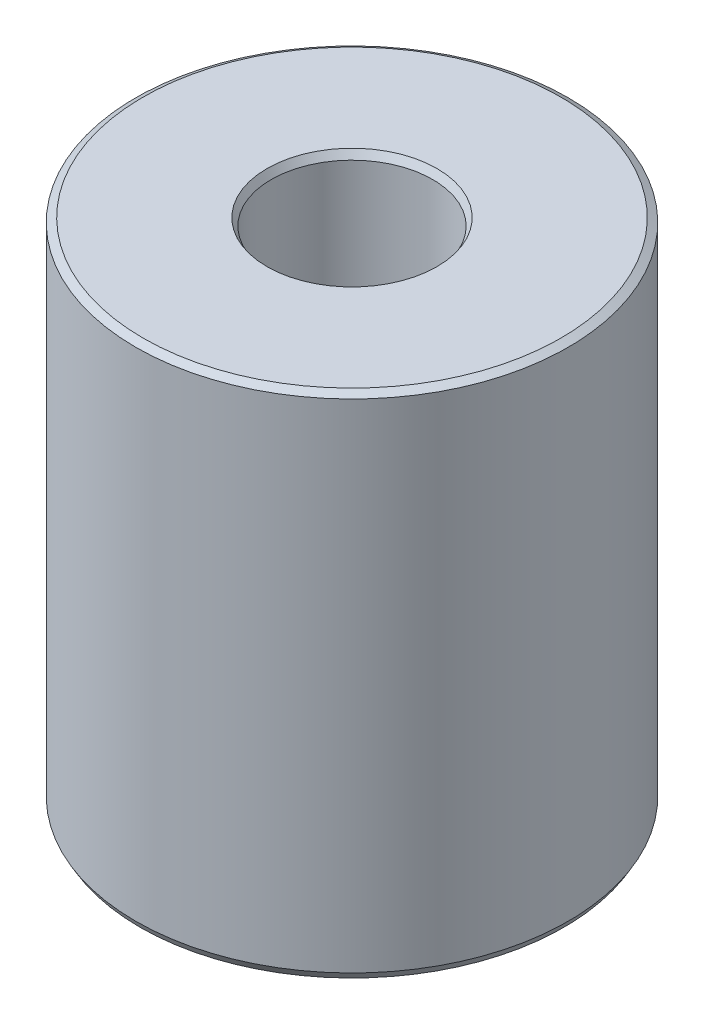
ISO-10303-21;
HEADER;
FILE_DESCRIPTION(('STEP AP214'),'2;1');
FILE_NAME('part.step','',(''),(''),'','','');
FILE_SCHEMA(('AUTOMOTIVE_DESIGN { 1 0 10303 214 1 1 1 1 }'));
ENDSEC;
DATA;
#1=APPLICATION_CONTEXT('core data for automotive mechanical design processes');
#2=APPLICATION_PROTOCOL_DEFINITION('international standard','automotive_design',2000,#1);
#3=PRODUCT_CONTEXT('',#1,'mechanical');
#4=PRODUCT('Part','Part','',(#3));
#5=PRODUCT_RELATED_PRODUCT_CATEGORY('part','',(#4));
#6=PRODUCT_DEFINITION_FORMATION('','',#4);
#7=PRODUCT_DEFINITION_CONTEXT('part definition',#1,'design');
#8=PRODUCT_DEFINITION('design','',#6,#7);
#9=PRODUCT_DEFINITION_SHAPE('','',#8);
#10=(LENGTH_UNIT() NAMED_UNIT(*) SI_UNIT(.MILLI.,.METRE.));
#11=(NAMED_UNIT(*) PLANE_ANGLE_UNIT() SI_UNIT($,.RADIAN.));
#12=(NAMED_UNIT(*) SI_UNIT($,.STERADIAN.) SOLID_ANGLE_UNIT());
#13=UNCERTAINTY_MEASURE_WITH_UNIT(LENGTH_MEASURE(1.E-05),#10,'distance_accuracy_value','');
#14=(GEOMETRIC_REPRESENTATION_CONTEXT(3) GLOBAL_UNCERTAINTY_ASSIGNED_CONTEXT((#13)) GLOBAL_UNIT_ASSIGNED_CONTEXT((#10,
#11,#12)) REPRESENTATION_CONTEXT('',''));
#15=CARTESIAN_POINT('',(0.,0.,0.));
#16=DIRECTION('',(0.,0.,1.));
#17=DIRECTION('',(1.,0.,0.));
#18=AXIS2_PLACEMENT_3D('',#15,#16,#17);
#19=CARTESIAN_POINT('',(0.,52.939973360736,0.));
#20=DIRECTION('',(0.,-1.,0.));
#21=DIRECTION('',(0.,0.,-1.));
#22=AXIS2_PLACEMENT_3D('',#19,#20,#21);
#23=CYLINDRICAL_SURFACE('',#22,22.5);
#24=CARTESIAN_POINT('',(0.,0.765818197632044,0.));
#25=DIRECTION('',(0.,1.,0.));
#26=DIRECTION('',(0.,0.,1.));
#27=AXIS2_PLACEMENT_3D('',#24,#25,#26);
#28=CIRCLE('',#27,22.5);
#29=CARTESIAN_POINT('',(0.,0.765818197632044,22.5));
#30=VERTEX_POINT('',#29);
#31=EDGE_CURVE('E10',#30,#30,#28,.T.);
#32=ORIENTED_EDGE('',*,*,#31,.T.);
#33=EDGE_LOOP('',(#32));
#34=FACE_BOUND('',#33,.T.);
#35=CARTESIAN_POINT('',(0.,52.4978280181829,0.));
#36=DIRECTION('',(0.,1.,0.));
#37=DIRECTION('',(0.,0.,1.));
#38=AXIS2_PLACEMENT_3D('',#35,#36,#37);
#39=CIRCLE('',#38,22.5);
#40=CARTESIAN_POINT('',(0.,52.4978280181829,22.5));
#41=VERTEX_POINT('',#40);
#42=EDGE_CURVE('E50',#41,#41,#39,.F.);
#43=ORIENTED_EDGE('',*,*,#42,.T.);
#44=EDGE_LOOP('',(#43));
#45=FACE_BOUND('',#44,.T.);
#46=ADVANCED_FACE('F39',(#34,#45),#23,.T.);
#47=CARTESIAN_POINT('',(0.,52.939973360736,0.));
#48=DIRECTION('',(0.,1.,0.));
#49=DIRECTION('',(0.,0.,1.));
#50=AXIS2_PLACEMENT_3D('',#47,#48,#49);
#51=PLANE('',#50);
#52=CARTESIAN_POINT('',(0.,52.939973360736,0.));
#53=DIRECTION('',(0.,1.,0.));
#54=DIRECTION('',(0.,0.,1.));
#55=AXIS2_PLACEMENT_3D('',#52,#53,#54);
#56=CIRCLE('',#55,8.84591755321129);
#57=CARTESIAN_POINT('',(0.,52.939973360736,8.84591755321129));
#58=VERTEX_POINT('',#57);
#59=EDGE_CURVE('E58',#58,#58,#56,.F.);
#60=ORIENTED_EDGE('',*,*,#59,.T.);
#61=EDGE_LOOP('',(#60));
#62=FACE_BOUND('',#61,.T.);
#63=CARTESIAN_POINT('',(0.,52.939973360736,0.));
#64=DIRECTION('',(0.,1.,0.));
#65=DIRECTION('',(0.,0.,1.));
#66=AXIS2_PLACEMENT_3D('',#63,#64,#65);
#67=CIRCLE('',#66,21.734181802368);
#68=CARTESIAN_POINT('',(0.,52.939973360736,21.734181802368));
#69=VERTEX_POINT('',#68);
#70=EDGE_CURVE('E61',#69,#69,#67,.T.);
#71=ORIENTED_EDGE('',*,*,#70,.T.);
#72=EDGE_LOOP('',(#71));
#73=FACE_BOUND('',#72,.T.);
#74=ADVANCED_FACE('F88',(#62,#73),#51,.T.);
#75=CARTESIAN_POINT('',(0.,0.,0.));
#76=DIRECTION('',(0.,1.,0.));
#77=DIRECTION('',(0.,0.,1.));
#78=AXIS2_PLACEMENT_3D('',#75,#76,#77);
#79=PLANE('',#78);
#80=CARTESIAN_POINT('',(0.,0.,0.));
#81=DIRECTION('',(0.,1.,0.));
#82=DIRECTION('',(0.,0.,1.));
#83=AXIS2_PLACEMENT_3D('',#80,#81,#82);
#84=CIRCLE('',#83,9.16959040829013);
#85=CARTESIAN_POINT('',(0.,0.,9.16959040829013));
#86=VERTEX_POINT('',#85);
#87=EDGE_CURVE('E51',#86,#86,#84,.T.);
#88=ORIENTED_EDGE('',*,*,#87,.T.);
#89=EDGE_LOOP('',(#88));
#90=FACE_BOUND('',#89,.T.);
#91=CARTESIAN_POINT('',(0.,0.,0.));
#92=DIRECTION('',(0.,1.,0.));
#93=DIRECTION('',(0.,0.,1.));
#94=AXIS2_PLACEMENT_3D('',#91,#92,#93);
#95=CIRCLE('',#94,22.0578546574468);
#96=CARTESIAN_POINT('',(0.,0.,22.0578546574468));
#97=VERTEX_POINT('',#96);
#98=EDGE_CURVE('E54',#97,#97,#95,.F.);
#99=ORIENTED_EDGE('',*,*,#98,.T.);
#100=EDGE_LOOP('',(#99));
#101=FACE_BOUND('',#100,.T.);
#102=ADVANCED_FACE('F83',(#90,#101),#79,.F.);
#103=CARTESIAN_POINT('',(0.,52.939973360736,0.));
#104=DIRECTION('',(0.,-1.,0.));
#105=DIRECTION('',(0.,0.,-1.));
#106=AXIS2_PLACEMENT_3D('',#103,#104,#105);
#107=CYLINDRICAL_SURFACE('',#106,8.40377221065813);
#108=CARTESIAN_POINT('',(0.,52.174155163104,0.));
#109=DIRECTION('',(0.,1.,0.));
#110=DIRECTION('',(0.,0.,1.));
#111=AXIS2_PLACEMENT_3D('',#108,#109,#110);
#112=CIRCLE('',#111,8.40377221065813);
#113=CARTESIAN_POINT('',(0.,52.174155163104,8.40377221065813));
#114=VERTEX_POINT('',#113);
#115=EDGE_CURVE('E67',#114,#114,#112,.T.);
#116=ORIENTED_EDGE('',*,*,#115,.T.);
#117=EDGE_LOOP('',(#116));
#118=FACE_BOUND('',#117,.T.);
#119=CARTESIAN_POINT('',(0.,0.442145342553164,0.));
#120=DIRECTION('',(0.,1.,0.));
#121=DIRECTION('',(0.,0.,1.));
#122=AXIS2_PLACEMENT_3D('',#119,#120,#121);
#123=CIRCLE('',#122,8.40377221065813);
#124=CARTESIAN_POINT('',(0.,0.442145342553164,8.40377221065813));
#125=VERTEX_POINT('',#124);
#126=EDGE_CURVE('E69',#125,#125,#123,.F.);
#127=ORIENTED_EDGE('',*,*,#126,.T.);
#128=EDGE_LOOP('',(#127));
#129=FACE_BOUND('',#128,.T.);
#130=ADVANCED_FACE('F71',(#118,#129),#107,.F.);
#131=CARTESIAN_POINT('',(0.,52.174155163104,0.));
#132=DIRECTION('',(0.,1.,0.));
#133=DIRECTION('',(0.,0.,1.));
#134=AXIS2_PLACEMENT_3D('',#131,#132,#133);
#135=CONICAL_SURFACE('',#134,8.40377221065813,0.523598775598302);
#136=ORIENTED_EDGE('',*,*,#59,.F.);
#137=EDGE_LOOP('',(#136));
#138=FACE_BOUND('',#137,.T.);
#139=ORIENTED_EDGE('',*,*,#115,.F.);
#140=EDGE_LOOP('',(#139));
#141=FACE_BOUND('',#140,.T.);
#142=ADVANCED_FACE('F77',(#138,#141),#135,.F.);
#143=CARTESIAN_POINT('',(0.,0.,0.));
#144=DIRECTION('',(0.,-1.,0.));
#145=DIRECTION('',(0.,0.,-1.));
#146=AXIS2_PLACEMENT_3D('',#143,#144,#145);
#147=CONICAL_SURFACE('',#146,9.16959040829013,1.04719755119659);
#148=ORIENTED_EDGE('',*,*,#126,.F.);
#149=EDGE_LOOP('',(#148));
#150=FACE_BOUND('',#149,.T.);
#151=ORIENTED_EDGE('',*,*,#87,.F.);
#152=EDGE_LOOP('',(#151));
#153=FACE_BOUND('',#152,.T.);
#154=ADVANCED_FACE('F73',(#150,#153),#147,.F.);
#155=CARTESIAN_POINT('',(0.,0.765818197632044,0.));
#156=DIRECTION('',(0.,1.,0.));
#157=DIRECTION('',(0.,0.,1.));
#158=AXIS2_PLACEMENT_3D('',#155,#156,#157);
#159=CONICAL_SURFACE('',#158,22.5,0.523598775598306);
#160=ORIENTED_EDGE('',*,*,#98,.F.);
#161=EDGE_LOOP('',(#160));
#162=FACE_BOUND('',#161,.T.);
#163=ORIENTED_EDGE('',*,*,#31,.F.);
#164=EDGE_LOOP('',(#163));
#165=FACE_BOUND('',#164,.T.);
#166=ADVANCED_FACE('F76',(#162,#165),#159,.T.);
#167=CARTESIAN_POINT('',(0.,52.939973360736,0.));
#168=DIRECTION('',(0.,-1.,0.));
#169=DIRECTION('',(0.,0.,-1.));
#170=AXIS2_PLACEMENT_3D('',#167,#168,#169);
#171=CONICAL_SURFACE('',#170,21.734181802368,1.0471975511966);
#172=ORIENTED_EDGE('',*,*,#42,.F.);
#173=EDGE_LOOP('',(#172));
#174=FACE_BOUND('',#173,.T.);
#175=ORIENTED_EDGE('',*,*,#70,.F.);
#176=EDGE_LOOP('',(#175));
#177=FACE_BOUND('',#176,.T.);
#178=ADVANCED_FACE('F45',(#174,#177),#171,.T.);
#179=CLOSED_SHELL('',(#46,#74,#102,#130,#142,#154,#166,#178));
#180=MANIFOLD_SOLID_BREP('B2',#179);
#181=ADVANCED_BREP_SHAPE_REPRESENTATION('',(#18,#180),#14);
#182=SHAPE_DEFINITION_REPRESENTATION(#9,#181);
ENDSEC;
END-ISO-10303-21;
